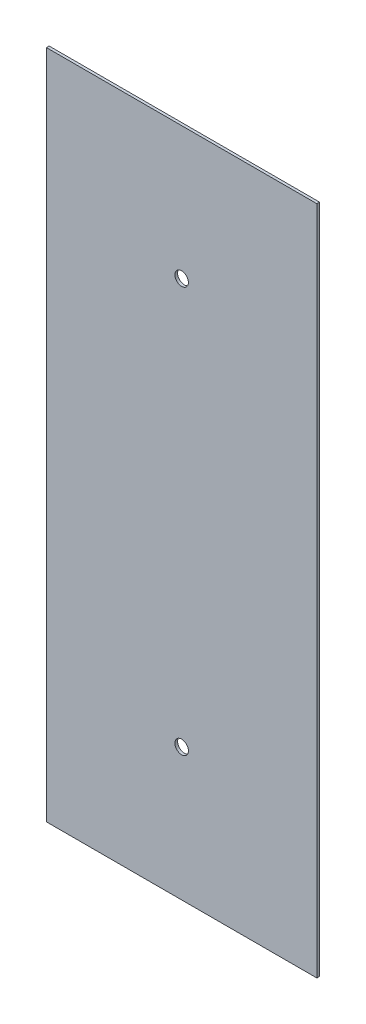
ISO-10303-21;
HEADER;
FILE_DESCRIPTION(('STEP AP214'),'2;1');
FILE_NAME('part.step','',(''),(''),'','','');
FILE_SCHEMA(('AUTOMOTIVE_DESIGN { 1 0 10303 214 1 1 1 1 }'));
ENDSEC;
DATA;
#1=APPLICATION_CONTEXT('core data for automotive mechanical design processes');
#2=APPLICATION_PROTOCOL_DEFINITION('international standard','automotive_design',2000,#1);
#3=PRODUCT_CONTEXT('',#1,'mechanical');
#4=PRODUCT('Part','Part','',(#3));
#5=PRODUCT_RELATED_PRODUCT_CATEGORY('part','',(#4));
#6=PRODUCT_DEFINITION_FORMATION('','',#4);
#7=PRODUCT_DEFINITION_CONTEXT('part definition',#1,'design');
#8=PRODUCT_DEFINITION('design','',#6,#7);
#9=PRODUCT_DEFINITION_SHAPE('','',#8);
#10=(LENGTH_UNIT() NAMED_UNIT(*) SI_UNIT(.MILLI.,.METRE.));
#11=(NAMED_UNIT(*) PLANE_ANGLE_UNIT() SI_UNIT($,.RADIAN.));
#12=(NAMED_UNIT(*) SI_UNIT($,.STERADIAN.) SOLID_ANGLE_UNIT());
#13=UNCERTAINTY_MEASURE_WITH_UNIT(LENGTH_MEASURE(1.E-05),#10,'distance_accuracy_value','');
#14=(GEOMETRIC_REPRESENTATION_CONTEXT(3) GLOBAL_UNCERTAINTY_ASSIGNED_CONTEXT((#13)) GLOBAL_UNIT_ASSIGNED_CONTEXT((#10,
#11,#12)) REPRESENTATION_CONTEXT('',''));
#15=CARTESIAN_POINT('',(0.,0.,0.));
#16=DIRECTION('',(0.,0.,1.));
#17=DIRECTION('',(1.,0.,0.));
#18=AXIS2_PLACEMENT_3D('',#15,#16,#17);
#19=CARTESIAN_POINT('',(0.,0.,2.));
#20=DIRECTION('',(0.,0.,-1.));
#21=DIRECTION('',(-1.,0.,0.));
#22=AXIS2_PLACEMENT_3D('',#19,#20,#21);
#23=PLANE('',#22);
#24=DIRECTION('',(0.,-1.,0.));
#25=VECTOR('',#24,1.);
#26=CARTESIAN_POINT('',(-100.,248.,2.));
#27=LINE('',#26,#25);
#28=CARTESIAN_POINT('',(-100.,248.,2.));
#29=VERTEX_POINT('',#28);
#30=CARTESIAN_POINT('',(-100.,-248.,2.));
#31=VERTEX_POINT('',#30);
#32=EDGE_CURVE('E86',#29,#31,#27,.T.);
#33=ORIENTED_EDGE('',*,*,#32,.T.);
#34=DIRECTION('',(1.,0.,0.));
#35=VECTOR('',#34,1.);
#36=CARTESIAN_POINT('',(100.,-248.,2.));
#37=LINE('',#36,#35);
#38=CARTESIAN_POINT('',(100.,-248.,2.));
#39=VERTEX_POINT('',#38);
#40=EDGE_CURVE('E81',#31,#39,#37,.T.);
#41=ORIENTED_EDGE('',*,*,#40,.T.);
#42=DIRECTION('',(0.,1.,0.));
#43=VECTOR('',#42,1.);
#44=CARTESIAN_POINT('',(100.,248.,2.));
#45=LINE('',#44,#43);
#46=CARTESIAN_POINT('',(100.,248.,2.));
#47=VERTEX_POINT('',#46);
#48=EDGE_CURVE('E84',#39,#47,#45,.T.);
#49=ORIENTED_EDGE('',*,*,#48,.T.);
#50=DIRECTION('',(-1.,0.,0.));
#51=VECTOR('',#50,1.);
#52=CARTESIAN_POINT('',(100.,248.,2.));
#53=LINE('',#52,#51);
#54=EDGE_CURVE('E51',#47,#29,#53,.T.);
#55=ORIENTED_EDGE('',*,*,#54,.T.);
#56=EDGE_LOOP('',(#33,#41,#49,#55));
#57=FACE_BOUND('',#56,.T.);
#58=CARTESIAN_POINT('',(0.,150.,2.));
#59=DIRECTION('',(0.,0.,1.));
#60=DIRECTION('',(1.,0.,0.));
#61=AXIS2_PLACEMENT_3D('',#58,#59,#60);
#62=CIRCLE('',#61,5.);
#63=CARTESIAN_POINT('',(5.,150.,2.));
#64=VERTEX_POINT('',#63);
#65=EDGE_CURVE('E101',#64,#64,#62,.T.);
#66=ORIENTED_EDGE('',*,*,#65,.F.);
#67=EDGE_LOOP('',(#66));
#68=FACE_BOUND('',#67,.T.);
#69=CARTESIAN_POINT('',(0.,-150.,2.));
#70=DIRECTION('',(0.,0.,1.));
#71=DIRECTION('',(1.,0.,0.));
#72=AXIS2_PLACEMENT_3D('',#69,#70,#71);
#73=CIRCLE('',#72,5.);
#74=CARTESIAN_POINT('',(5.,-150.,2.));
#75=VERTEX_POINT('',#74);
#76=EDGE_CURVE('E116',#75,#75,#73,.T.);
#77=ORIENTED_EDGE('',*,*,#76,.F.);
#78=EDGE_LOOP('',(#77));
#79=FACE_BOUND('',#78,.T.);
#80=ADVANCED_FACE('F34',(#57,#68,#79),#23,.F.);
#81=CARTESIAN_POINT('',(0.,0.,0.));
#82=DIRECTION('',(0.,0.,-1.));
#83=DIRECTION('',(-1.,0.,0.));
#84=AXIS2_PLACEMENT_3D('',#81,#82,#83);
#85=PLANE('',#84);
#86=CARTESIAN_POINT('',(0.,150.,0.));
#87=DIRECTION('',(0.,0.,1.));
#88=DIRECTION('',(1.,0.,0.));
#89=AXIS2_PLACEMENT_3D('',#86,#87,#88);
#90=CIRCLE('',#89,5.);
#91=CARTESIAN_POINT('',(5.,150.,0.));
#92=VERTEX_POINT('',#91);
#93=EDGE_CURVE('E113',#92,#92,#90,.T.);
#94=ORIENTED_EDGE('',*,*,#93,.T.);
#95=EDGE_LOOP('',(#94));
#96=FACE_BOUND('',#95,.T.);
#97=DIRECTION('',(0.,-1.,0.));
#98=VECTOR('',#97,1.);
#99=CARTESIAN_POINT('',(-100.,248.,0.));
#100=LINE('',#99,#98);
#101=CARTESIAN_POINT('',(-100.,248.,0.));
#102=VERTEX_POINT('',#101);
#103=CARTESIAN_POINT('',(-100.,-248.,0.));
#104=VERTEX_POINT('',#103);
#105=EDGE_CURVE('E98',#102,#104,#100,.T.);
#106=ORIENTED_EDGE('',*,*,#105,.F.);
#107=DIRECTION('',(-1.,0.,0.));
#108=VECTOR('',#107,1.);
#109=CARTESIAN_POINT('',(100.,248.,0.));
#110=LINE('',#109,#108);
#111=CARTESIAN_POINT('',(100.,248.,0.));
#112=VERTEX_POINT('',#111);
#113=EDGE_CURVE('E74',#112,#102,#110,.T.);
#114=ORIENTED_EDGE('',*,*,#113,.F.);
#115=DIRECTION('',(0.,1.,0.));
#116=VECTOR('',#115,1.);
#117=CARTESIAN_POINT('',(100.,248.,0.));
#118=LINE('',#117,#116);
#119=CARTESIAN_POINT('',(100.,-248.,0.));
#120=VERTEX_POINT('',#119);
#121=EDGE_CURVE('E68',#120,#112,#118,.T.);
#122=ORIENTED_EDGE('',*,*,#121,.F.);
#123=DIRECTION('',(1.,0.,0.));
#124=VECTOR('',#123,1.);
#125=CARTESIAN_POINT('',(100.,-248.,0.));
#126=LINE('',#125,#124);
#127=EDGE_CURVE('E90',#104,#120,#126,.T.);
#128=ORIENTED_EDGE('',*,*,#127,.F.);
#129=EDGE_LOOP('',(#106,#114,#122,#128));
#130=FACE_BOUND('',#129,.T.);
#131=CARTESIAN_POINT('',(0.,-150.,0.));
#132=DIRECTION('',(0.,0.,1.));
#133=DIRECTION('',(1.,0.,0.));
#134=AXIS2_PLACEMENT_3D('',#131,#132,#133);
#135=CIRCLE('',#134,5.);
#136=CARTESIAN_POINT('',(5.,-150.,0.));
#137=VERTEX_POINT('',#136);
#138=EDGE_CURVE('E119',#137,#137,#135,.T.);
#139=ORIENTED_EDGE('',*,*,#138,.T.);
#140=EDGE_LOOP('',(#139));
#141=FACE_BOUND('',#140,.T.);
#142=ADVANCED_FACE('F109',(#96,#130,#141),#85,.T.);
#143=CARTESIAN_POINT('',(-100.,248.,2.));
#144=DIRECTION('',(1.,0.,0.));
#145=DIRECTION('',(0.,1.,0.));
#146=AXIS2_PLACEMENT_3D('',#143,#144,#145);
#147=PLANE('',#146);
#148=ORIENTED_EDGE('',*,*,#105,.T.);
#149=DIRECTION('',(0.,0.,-1.));
#150=VECTOR('',#149,1.);
#151=CARTESIAN_POINT('',(-100.,-248.,2.));
#152=LINE('',#151,#150);
#153=EDGE_CURVE('E11',#31,#104,#152,.T.);
#154=ORIENTED_EDGE('',*,*,#153,.F.);
#155=ORIENTED_EDGE('',*,*,#32,.F.);
#156=DIRECTION('',(0.,0.,-1.));
#157=VECTOR('',#156,1.);
#158=CARTESIAN_POINT('',(-100.,248.,2.));
#159=LINE('',#158,#157);
#160=EDGE_CURVE('E94',#29,#102,#159,.T.);
#161=ORIENTED_EDGE('',*,*,#160,.T.);
#162=EDGE_LOOP('',(#148,#154,#155,#161));
#163=FACE_BOUND('',#162,.T.);
#164=ADVANCED_FACE('F36',(#163),#147,.F.);
#165=CARTESIAN_POINT('',(100.,-248.,2.));
#166=DIRECTION('',(0.,1.,0.));
#167=DIRECTION('',(0.,0.,1.));
#168=AXIS2_PLACEMENT_3D('',#165,#166,#167);
#169=PLANE('',#168);
#170=ORIENTED_EDGE('',*,*,#127,.T.);
#171=DIRECTION('',(0.,0.,-1.));
#172=VECTOR('',#171,1.);
#173=CARTESIAN_POINT('',(100.,-248.,2.));
#174=LINE('',#173,#172);
#175=EDGE_CURVE('E43',#39,#120,#174,.T.);
#176=ORIENTED_EDGE('',*,*,#175,.F.);
#177=ORIENTED_EDGE('',*,*,#40,.F.);
#178=ORIENTED_EDGE('',*,*,#153,.T.);
#179=EDGE_LOOP('',(#170,#176,#177,#178));
#180=FACE_BOUND('',#179,.T.);
#181=ADVANCED_FACE('F89',(#180),#169,.F.);
#182=CARTESIAN_POINT('',(100.,248.,2.));
#183=DIRECTION('',(-1.,0.,0.));
#184=DIRECTION('',(0.,-1.,0.));
#185=AXIS2_PLACEMENT_3D('',#182,#183,#184);
#186=PLANE('',#185);
#187=ORIENTED_EDGE('',*,*,#121,.T.);
#188=DIRECTION('',(0.,0.,-1.));
#189=VECTOR('',#188,1.);
#190=CARTESIAN_POINT('',(100.,248.,2.));
#191=LINE('',#190,#189);
#192=EDGE_CURVE('E91',#47,#112,#191,.T.);
#193=ORIENTED_EDGE('',*,*,#192,.F.);
#194=ORIENTED_EDGE('',*,*,#48,.F.);
#195=ORIENTED_EDGE('',*,*,#175,.T.);
#196=EDGE_LOOP('',(#187,#193,#194,#195));
#197=FACE_BOUND('',#196,.T.);
#198=ADVANCED_FACE('F92',(#197),#186,.F.);
#199=CARTESIAN_POINT('',(100.,248.,2.));
#200=DIRECTION('',(0.,-1.,0.));
#201=DIRECTION('',(1.,0.,0.));
#202=AXIS2_PLACEMENT_3D('',#199,#200,#201);
#203=PLANE('',#202);
#204=ORIENTED_EDGE('',*,*,#113,.T.);
#205=ORIENTED_EDGE('',*,*,#160,.F.);
#206=ORIENTED_EDGE('',*,*,#54,.F.);
#207=ORIENTED_EDGE('',*,*,#192,.T.);
#208=EDGE_LOOP('',(#204,#205,#206,#207));
#209=FACE_BOUND('',#208,.T.);
#210=ADVANCED_FACE('F106',(#209),#203,.F.);
#211=CARTESIAN_POINT('',(0.,150.,2.));
#212=DIRECTION('',(0.,0.,-1.));
#213=DIRECTION('',(-1.,0.,0.));
#214=AXIS2_PLACEMENT_3D('',#211,#212,#213);
#215=CYLINDRICAL_SURFACE('',#214,5.);
#216=ORIENTED_EDGE('',*,*,#65,.T.);
#217=EDGE_LOOP('',(#216));
#218=FACE_BOUND('',#217,.T.);
#219=ORIENTED_EDGE('',*,*,#93,.F.);
#220=EDGE_LOOP('',(#219));
#221=FACE_BOUND('',#220,.T.);
#222=ADVANCED_FACE('F136',(#218,#221),#215,.F.);
#223=CARTESIAN_POINT('',(0.,-150.,2.));
#224=DIRECTION('',(0.,0.,-1.));
#225=DIRECTION('',(-1.,0.,0.));
#226=AXIS2_PLACEMENT_3D('',#223,#224,#225);
#227=CYLINDRICAL_SURFACE('',#226,5.);
#228=ORIENTED_EDGE('',*,*,#76,.T.);
#229=EDGE_LOOP('',(#228));
#230=FACE_BOUND('',#229,.T.);
#231=ORIENTED_EDGE('',*,*,#138,.F.);
#232=EDGE_LOOP('',(#231));
#233=FACE_BOUND('',#232,.T.);
#234=ADVANCED_FACE('F125',(#230,#233),#227,.F.);
#235=CLOSED_SHELL('',(#80,#142,#164,#181,#198,#210,#222,#234));
#236=MANIFOLD_SOLID_BREP('B2',#235);
#237=ADVANCED_BREP_SHAPE_REPRESENTATION('',(#18,#236),#14);
#238=SHAPE_DEFINITION_REPRESENTATION(#9,#237);
ENDSEC;
END-ISO-10303-21;
